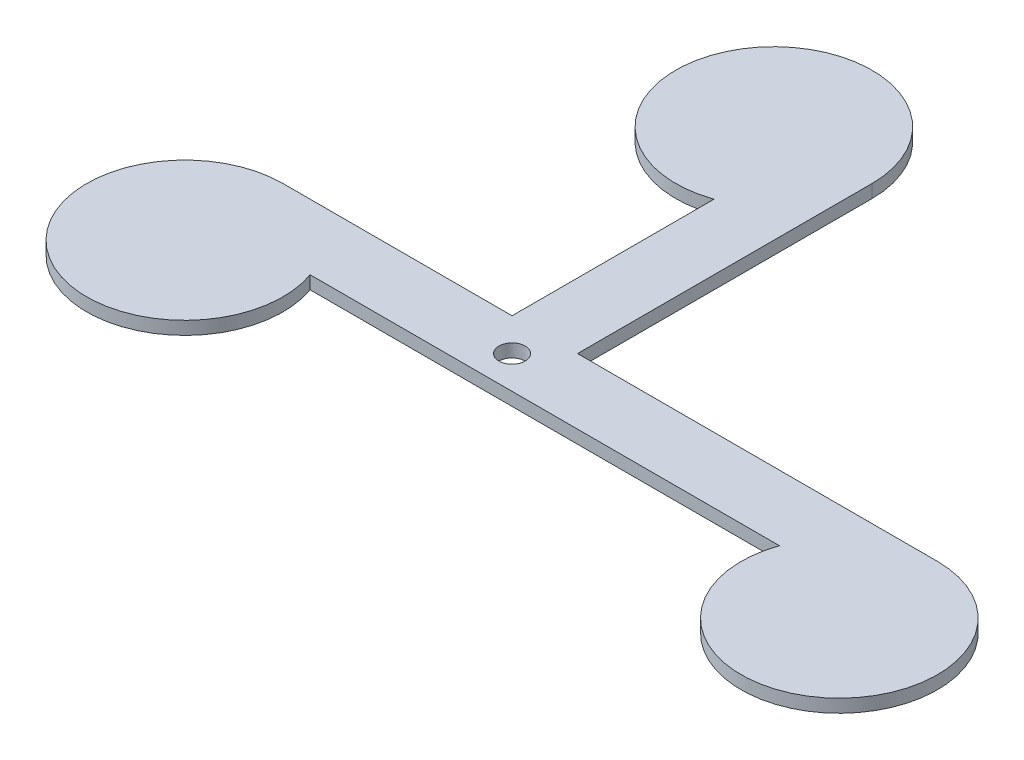
ISO-10303-21;
HEADER;
FILE_DESCRIPTION(('STEP AP214'),'2;1');
FILE_NAME('part.step','',(''),(''),'','','');
FILE_SCHEMA(('AUTOMOTIVE_DESIGN { 1 0 10303 214 1 1 1 1 }'));
ENDSEC;
DATA;
#1=APPLICATION_CONTEXT('core data for automotive mechanical design processes');
#2=APPLICATION_PROTOCOL_DEFINITION('international standard','automotive_design',2000,#1);
#3=PRODUCT_CONTEXT('',#1,'mechanical');
#4=PRODUCT('Part','Part','',(#3));
#5=PRODUCT_RELATED_PRODUCT_CATEGORY('part','',(#4));
#6=PRODUCT_DEFINITION_FORMATION('','',#4);
#7=PRODUCT_DEFINITION_CONTEXT('part definition',#1,'design');
#8=PRODUCT_DEFINITION('design','',#6,#7);
#9=PRODUCT_DEFINITION_SHAPE('','',#8);
#10=(LENGTH_UNIT() NAMED_UNIT(*) SI_UNIT(.MILLI.,.METRE.));
#11=(NAMED_UNIT(*) PLANE_ANGLE_UNIT() SI_UNIT($,.RADIAN.));
#12=(NAMED_UNIT(*) SI_UNIT($,.STERADIAN.) SOLID_ANGLE_UNIT());
#13=UNCERTAINTY_MEASURE_WITH_UNIT(LENGTH_MEASURE(1.E-05),#10,'distance_accuracy_value','');
#14=(GEOMETRIC_REPRESENTATION_CONTEXT(3) GLOBAL_UNCERTAINTY_ASSIGNED_CONTEXT((#13)) GLOBAL_UNIT_ASSIGNED_CONTEXT((#10,
#11,#12)) REPRESENTATION_CONTEXT('',''));
#15=CARTESIAN_POINT('',(0.,0.,0.));
#16=DIRECTION('',(0.,0.,1.));
#17=DIRECTION('',(1.,0.,0.));
#18=AXIS2_PLACEMENT_3D('',#15,#16,#17);
#19=CARTESIAN_POINT('',(45.,2.,-15.));
#20=DIRECTION('',(-1.,0.,0.));
#21=DIRECTION('',(0.,0.,1.));
#22=AXIS2_PLACEMENT_3D('',#19,#20,#21);
#23=PLANE('',#22);
#24=DIRECTION('',(0.,0.,-1.));
#25=VECTOR('',#24,1.);
#26=CARTESIAN_POINT('',(45.,0.,-15.));
#27=LINE('',#26,#25);
#28=CARTESIAN_POINT('',(45.,0.,-15.));
#29=VERTEX_POINT('',#28);
#30=CARTESIAN_POINT('',(45.,0.,-60.));
#31=VERTEX_POINT('',#30);
#32=EDGE_CURVE('E131',#29,#31,#27,.T.);
#33=ORIENTED_EDGE('',*,*,#32,.T.);
#34=DIRECTION('',(0.,-1.,0.));
#35=VECTOR('',#34,1.);
#36=CARTESIAN_POINT('',(45.,2.,-60.));
#37=LINE('',#36,#35);
#38=CARTESIAN_POINT('',(45.,2.,-60.));
#39=VERTEX_POINT('',#38);
#40=EDGE_CURVE('E162',#39,#31,#37,.T.);
#41=ORIENTED_EDGE('',*,*,#40,.F.);
#42=DIRECTION('',(0.,0.,-1.));
#43=VECTOR('',#42,1.);
#44=CARTESIAN_POINT('',(45.,2.,-15.));
#45=LINE('',#44,#43);
#46=CARTESIAN_POINT('',(45.,2.,-15.));
#47=VERTEX_POINT('',#46);
#48=EDGE_CURVE('E151',#47,#39,#45,.T.);
#49=ORIENTED_EDGE('',*,*,#48,.F.);
#50=DIRECTION('',(0.,-1.,0.));
#51=VECTOR('',#50,1.);
#52=CARTESIAN_POINT('',(45.,2.,-15.));
#53=LINE('',#52,#51);
#54=EDGE_CURVE('E50',#47,#29,#53,.T.);
#55=ORIENTED_EDGE('',*,*,#54,.T.);
#56=EDGE_LOOP('',(#33,#41,#49,#55));
#57=FACE_BOUND('',#56,.T.);
#58=ADVANCED_FACE('F33',(#57),#23,.F.);
#59=CARTESIAN_POINT('',(30.,2.,-60.));
#60=DIRECTION('',(0.,-1.,0.));
#61=DIRECTION('',(0.,0.,-1.));
#62=AXIS2_PLACEMENT_3D('',#59,#60,#61);
#63=CYLINDRICAL_SURFACE('',#62,15.);
#64=CARTESIAN_POINT('',(30.,0.,-60.));
#65=DIRECTION('',(0.,1.,0.));
#66=DIRECTION('',(0.,0.,1.));
#67=AXIS2_PLACEMENT_3D('',#64,#65,#66);
#68=CIRCLE('',#67,15.);
#69=CARTESIAN_POINT('',(35.,0.,-45.857864376269));
#70=VERTEX_POINT('',#69);
#71=EDGE_CURVE('E133',#31,#70,#68,.T.);
#72=ORIENTED_EDGE('',*,*,#71,.T.);
#73=DIRECTION('',(0.,-1.,0.));
#74=VECTOR('',#73,1.);
#75=CARTESIAN_POINT('',(35.,2.,-45.857864376269));
#76=LINE('',#75,#74);
#77=CARTESIAN_POINT('',(35.,2.,-45.857864376269));
#78=VERTEX_POINT('',#77);
#79=EDGE_CURVE('E160',#78,#70,#76,.T.);
#80=ORIENTED_EDGE('',*,*,#79,.F.);
#81=CARTESIAN_POINT('',(30.,2.,-60.));
#82=DIRECTION('',(0.,1.,0.));
#83=DIRECTION('',(0.,0.,1.));
#84=AXIS2_PLACEMENT_3D('',#81,#82,#83);
#85=CIRCLE('',#84,15.);
#86=EDGE_CURVE('E90',#39,#78,#85,.T.);
#87=ORIENTED_EDGE('',*,*,#86,.F.);
#88=ORIENTED_EDGE('',*,*,#40,.T.);
#89=EDGE_LOOP('',(#72,#80,#87,#88));
#90=FACE_BOUND('',#89,.T.);
#91=ADVANCED_FACE('F180',(#90),#63,.T.);
#92=CARTESIAN_POINT('',(35.,2.,-15.));
#93=DIRECTION('',(-1.,0.,0.));
#94=DIRECTION('',(0.,0.,1.));
#95=AXIS2_PLACEMENT_3D('',#92,#93,#94);
#96=PLANE('',#95);
#97=DIRECTION('',(0.,0.,-1.));
#98=VECTOR('',#97,1.);
#99=CARTESIAN_POINT('',(35.,0.,-15.));
#100=LINE('',#99,#98);
#101=CARTESIAN_POINT('',(35.,0.,-15.));
#102=VERTEX_POINT('',#101);
#103=EDGE_CURVE('E137',#102,#70,#100,.T.);
#104=ORIENTED_EDGE('',*,*,#103,.F.);
#105=DIRECTION('',(0.,-1.,0.));
#106=VECTOR('',#105,1.);
#107=CARTESIAN_POINT('',(35.,2.,-15.));
#108=LINE('',#107,#106);
#109=CARTESIAN_POINT('',(35.,2.,-15.));
#110=VERTEX_POINT('',#109);
#111=EDGE_CURVE('E158',#110,#102,#108,.T.);
#112=ORIENTED_EDGE('',*,*,#111,.F.);
#113=DIRECTION('',(0.,0.,-1.));
#114=VECTOR('',#113,1.);
#115=CARTESIAN_POINT('',(35.,2.,-15.));
#116=LINE('',#115,#114);
#117=EDGE_CURVE('E234',#110,#78,#116,.T.);
#118=ORIENTED_EDGE('',*,*,#117,.T.);
#119=ORIENTED_EDGE('',*,*,#79,.T.);
#120=EDGE_LOOP('',(#104,#112,#118,#119));
#121=FACE_BOUND('',#120,.T.);
#122=ADVANCED_FACE('F184',(#121),#96,.T.);
#123=CARTESIAN_POINT('',(35.,2.,-15.));
#124=DIRECTION('',(0.,0.,1.));
#125=DIRECTION('',(1.,0.,0.));
#126=AXIS2_PLACEMENT_3D('',#123,#124,#125);
#127=PLANE('',#126);
#128=DIRECTION('',(-1.,0.,0.));
#129=VECTOR('',#128,1.);
#130=CARTESIAN_POINT('',(35.,0.,-15.));
#131=LINE('',#130,#129);
#132=CARTESIAN_POINT('',(0.,0.,-15.));
#133=VERTEX_POINT('',#132);
#134=EDGE_CURVE('E140',#102,#133,#131,.T.);
#135=ORIENTED_EDGE('',*,*,#134,.T.);
#136=DIRECTION('',(0.,-1.,0.));
#137=VECTOR('',#136,1.);
#138=CARTESIAN_POINT('',(0.,2.,-15.));
#139=LINE('',#138,#137);
#140=CARTESIAN_POINT('',(0.,2.,-15.));
#141=VERTEX_POINT('',#140);
#142=EDGE_CURVE('E155',#141,#133,#139,.T.);
#143=ORIENTED_EDGE('',*,*,#142,.F.);
#144=DIRECTION('',(-1.,0.,0.));
#145=VECTOR('',#144,1.);
#146=CARTESIAN_POINT('',(35.,2.,-15.));
#147=LINE('',#146,#145);
#148=EDGE_CURVE('E235',#110,#141,#147,.T.);
#149=ORIENTED_EDGE('',*,*,#148,.F.);
#150=ORIENTED_EDGE('',*,*,#111,.T.);
#151=EDGE_LOOP('',(#135,#143,#149,#150));
#152=FACE_BOUND('',#151,.T.);
#153=ADVANCED_FACE('F189',(#152),#127,.F.);
#154=CARTESIAN_POINT('',(0.,2.,0.));
#155=DIRECTION('',(0.,-1.,0.));
#156=DIRECTION('',(0.,0.,-1.));
#157=AXIS2_PLACEMENT_3D('',#154,#155,#156);
#158=CYLINDRICAL_SURFACE('',#157,15.);
#159=CARTESIAN_POINT('',(0.,0.,0.));
#160=DIRECTION('',(0.,1.,0.));
#161=DIRECTION('',(0.,0.,1.));
#162=AXIS2_PLACEMENT_3D('',#159,#160,#161);
#163=CIRCLE('',#162,15.);
#164=CARTESIAN_POINT('',(14.1421356237309,0.,-5.00000000000001));
#165=VERTEX_POINT('',#164);
#166=EDGE_CURVE('E142',#133,#165,#163,.T.);
#167=ORIENTED_EDGE('',*,*,#166,.T.);
#168=DIRECTION('',(0.,-1.,0.));
#169=VECTOR('',#168,1.);
#170=CARTESIAN_POINT('',(14.1421356237309,2.,-5.00000000000001));
#171=LINE('',#170,#169);
#172=CARTESIAN_POINT('',(14.1421356237309,2.,-5.00000000000001));
#173=VERTEX_POINT('',#172);
#174=EDGE_CURVE('E123',#173,#165,#171,.T.);
#175=ORIENTED_EDGE('',*,*,#174,.F.);
#176=CARTESIAN_POINT('',(0.,2.,0.));
#177=DIRECTION('',(0.,1.,0.));
#178=DIRECTION('',(0.,0.,1.));
#179=AXIS2_PLACEMENT_3D('',#176,#177,#178);
#180=CIRCLE('',#179,15.);
#181=EDGE_CURVE('E112',#141,#173,#180,.T.);
#182=ORIENTED_EDGE('',*,*,#181,.F.);
#183=ORIENTED_EDGE('',*,*,#142,.T.);
#184=EDGE_LOOP('',(#167,#175,#182,#183));
#185=FACE_BOUND('',#184,.T.);
#186=ADVANCED_FACE('F193',(#185),#158,.T.);
#187=CARTESIAN_POINT('',(45.,2.,-5.));
#188=DIRECTION('',(0.,0.,-1.));
#189=DIRECTION('',(-1.,0.,0.));
#190=AXIS2_PLACEMENT_3D('',#187,#188,#189);
#191=PLANE('',#190);
#192=DIRECTION('',(1.,0.,0.));
#193=VECTOR('',#192,1.);
#194=CARTESIAN_POINT('',(45.,0.,-5.));
#195=LINE('',#194,#193);
#196=CARTESIAN_POINT('',(85.857864376269,0.,-5.));
#197=VERTEX_POINT('',#196);
#198=EDGE_CURVE('E120',#165,#197,#195,.T.);
#199=ORIENTED_EDGE('',*,*,#198,.T.);
#200=DIRECTION('',(0.,-1.,0.));
#201=VECTOR('',#200,1.);
#202=CARTESIAN_POINT('',(85.857864376269,2.,-5.));
#203=LINE('',#202,#201);
#204=CARTESIAN_POINT('',(85.857864376269,2.,-5.));
#205=VERTEX_POINT('',#204);
#206=EDGE_CURVE('E118',#205,#197,#203,.T.);
#207=ORIENTED_EDGE('',*,*,#206,.F.);
#208=DIRECTION('',(-1.,0.,0.));
#209=VECTOR('',#208,1.);
#210=CARTESIAN_POINT('',(45.,2.,-5.));
#211=LINE('',#210,#209);
#212=EDGE_CURVE('E105',#205,#173,#211,.T.);
#213=ORIENTED_EDGE('',*,*,#212,.T.);
#214=ORIENTED_EDGE('',*,*,#174,.T.);
#215=EDGE_LOOP('',(#199,#207,#213,#214));
#216=FACE_BOUND('',#215,.T.);
#217=ADVANCED_FACE('F119',(#216),#191,.F.);
#218=CARTESIAN_POINT('',(100.,2.,0.));
#219=DIRECTION('',(0.,-1.,0.));
#220=DIRECTION('',(0.,0.,-1.));
#221=AXIS2_PLACEMENT_3D('',#218,#219,#220);
#222=CYLINDRICAL_SURFACE('',#221,15.);
#223=CARTESIAN_POINT('',(100.,0.,0.));
#224=DIRECTION('',(0.,1.,0.));
#225=DIRECTION('',(0.,0.,1.));
#226=AXIS2_PLACEMENT_3D('',#223,#224,#225);
#227=CIRCLE('',#226,15.);
#228=CARTESIAN_POINT('',(100.,0.,-15.));
#229=VERTEX_POINT('',#228);
#230=EDGE_CURVE('E146',#197,#229,#227,.T.);
#231=ORIENTED_EDGE('',*,*,#230,.T.);
#232=DIRECTION('',(0.,-1.,0.));
#233=VECTOR('',#232,1.);
#234=CARTESIAN_POINT('',(100.,2.,-15.));
#235=LINE('',#234,#233);
#236=CARTESIAN_POINT('',(100.,2.,-15.));
#237=VERTEX_POINT('',#236);
#238=EDGE_CURVE('E77',#237,#229,#235,.T.);
#239=ORIENTED_EDGE('',*,*,#238,.F.);
#240=CARTESIAN_POINT('',(100.,2.,0.));
#241=DIRECTION('',(0.,1.,0.));
#242=DIRECTION('',(0.,0.,1.));
#243=AXIS2_PLACEMENT_3D('',#240,#241,#242);
#244=CIRCLE('',#243,15.);
#245=EDGE_CURVE('E110',#205,#237,#244,.T.);
#246=ORIENTED_EDGE('',*,*,#245,.F.);
#247=ORIENTED_EDGE('',*,*,#206,.T.);
#248=EDGE_LOOP('',(#231,#239,#246,#247));
#249=FACE_BOUND('',#248,.T.);
#250=ADVANCED_FACE('F125',(#249),#222,.T.);
#251=CARTESIAN_POINT('',(45.,2.,-15.));
#252=DIRECTION('',(0.,0.,-1.));
#253=DIRECTION('',(-1.,0.,0.));
#254=AXIS2_PLACEMENT_3D('',#251,#252,#253);
#255=PLANE('',#254);
#256=DIRECTION('',(1.,0.,0.));
#257=VECTOR('',#256,1.);
#258=CARTESIAN_POINT('',(45.,0.,-15.));
#259=LINE('',#258,#257);
#260=EDGE_CURVE('E148',#29,#229,#259,.T.);
#261=ORIENTED_EDGE('',*,*,#260,.F.);
#262=ORIENTED_EDGE('',*,*,#54,.F.);
#263=DIRECTION('',(1.,0.,0.));
#264=VECTOR('',#263,1.);
#265=CARTESIAN_POINT('',(45.,2.,-15.));
#266=LINE('',#265,#264);
#267=EDGE_CURVE('E126',#47,#237,#266,.T.);
#268=ORIENTED_EDGE('',*,*,#267,.T.);
#269=ORIENTED_EDGE('',*,*,#238,.T.);
#270=EDGE_LOOP('',(#261,#262,#268,#269));
#271=FACE_BOUND('',#270,.T.);
#272=ADVANCED_FACE('F202',(#271),#255,.T.);
#273=CARTESIAN_POINT('',(30.,2.,-60.));
#274=DIRECTION('',(0.,1.,0.));
#275=DIRECTION('',(0.,0.,1.));
#276=AXIS2_PLACEMENT_3D('',#273,#274,#275);
#277=PLANE('',#276);
#278=CARTESIAN_POINT('',(40.,2.,-10.));
#279=DIRECTION('',(0.,-1.,0.));
#280=DIRECTION('',(0.,0.,-1.));
#281=AXIS2_PLACEMENT_3D('',#278,#279,#280);
#282=CIRCLE('',#281,2.);
#283=CARTESIAN_POINT('',(40.,2.,-12.));
#284=VERTEX_POINT('',#283);
#285=EDGE_CURVE('E134',#284,#284,#282,.T.);
#286=ORIENTED_EDGE('',*,*,#285,.T.);
#287=EDGE_LOOP('',(#286));
#288=FACE_BOUND('',#287,.T.);
#289=ORIENTED_EDGE('',*,*,#48,.T.);
#290=ORIENTED_EDGE('',*,*,#86,.T.);
#291=ORIENTED_EDGE('',*,*,#117,.F.);
#292=ORIENTED_EDGE('',*,*,#148,.T.);
#293=ORIENTED_EDGE('',*,*,#181,.T.);
#294=ORIENTED_EDGE('',*,*,#212,.F.);
#295=ORIENTED_EDGE('',*,*,#245,.T.);
#296=ORIENTED_EDGE('',*,*,#267,.F.);
#297=EDGE_LOOP('',(#289,#290,#291,#292,#293,#294,#295,#296));
#298=FACE_BOUND('',#297,.T.);
#299=ADVANCED_FACE('F107',(#288,#298),#277,.T.);
#300=CARTESIAN_POINT('',(30.,0.,-60.));
#301=DIRECTION('',(0.,1.,0.));
#302=DIRECTION('',(0.,0.,1.));
#303=AXIS2_PLACEMENT_3D('',#300,#301,#302);
#304=PLANE('',#303);
#305=CARTESIAN_POINT('',(40.,0.,-16.5));
#306=DIRECTION('',(0.,1.,0.));
#307=DIRECTION('',(0.,0.,1.));
#308=AXIS2_PLACEMENT_3D('',#305,#306,#307);
#309=CIRCLE('',#308,2.45);
#310=CARTESIAN_POINT('',(40.,0.,-14.05));
#311=VERTEX_POINT('',#310);
#312=EDGE_CURVE('E164',#311,#311,#309,.F.);
#313=ORIENTED_EDGE('',*,*,#312,.F.);
#314=EDGE_LOOP('',(#313));
#315=FACE_BOUND('',#314,.T.);
#316=CARTESIAN_POINT('',(40.,0.,-10.));
#317=DIRECTION('',(0.,-1.,0.));
#318=DIRECTION('',(0.,0.,-1.));
#319=AXIS2_PLACEMENT_3D('',#316,#317,#318);
#320=CIRCLE('',#319,2.);
#321=CARTESIAN_POINT('',(40.,0.,-12.));
#322=VERTEX_POINT('',#321);
#323=EDGE_CURVE('E226',#322,#322,#320,.T.);
#324=ORIENTED_EDGE('',*,*,#323,.F.);
#325=EDGE_LOOP('',(#324));
#326=FACE_BOUND('',#325,.T.);
#327=ORIENTED_EDGE('',*,*,#32,.F.);
#328=ORIENTED_EDGE('',*,*,#260,.T.);
#329=ORIENTED_EDGE('',*,*,#230,.F.);
#330=ORIENTED_EDGE('',*,*,#198,.F.);
#331=ORIENTED_EDGE('',*,*,#166,.F.);
#332=ORIENTED_EDGE('',*,*,#134,.F.);
#333=ORIENTED_EDGE('',*,*,#103,.T.);
#334=ORIENTED_EDGE('',*,*,#71,.F.);
#335=EDGE_LOOP('',(#327,#328,#329,#330,#331,#332,#333,#334));
#336=FACE_BOUND('',#335,.T.);
#337=ADVANCED_FACE('F205',(#315,#326,#336),#304,.F.);
#338=CARTESIAN_POINT('',(40.,2.,-10.));
#339=DIRECTION('',(0.,-1.,0.));
#340=DIRECTION('',(0.,0.,-1.));
#341=AXIS2_PLACEMENT_3D('',#338,#339,#340);
#342=CYLINDRICAL_SURFACE('',#341,2.);
#343=ORIENTED_EDGE('',*,*,#285,.F.);
#344=EDGE_LOOP('',(#343));
#345=FACE_BOUND('',#344,.T.);
#346=ORIENTED_EDGE('',*,*,#323,.T.);
#347=EDGE_LOOP('',(#346));
#348=FACE_BOUND('',#347,.T.);
#349=ADVANCED_FACE('F208',(#345,#348),#342,.F.);
#350=CARTESIAN_POINT('',(40.,-2.,-16.5));
#351=DIRECTION('',(0.,1.,0.));
#352=DIRECTION('',(0.,0.,1.));
#353=AXIS2_PLACEMENT_3D('',#350,#351,#352);
#354=CYLINDRICAL_SURFACE('',#353,2.45);
#355=CARTESIAN_POINT('',(40.,-1.,-16.5));
#356=DIRECTION('',(0.,-1.,0.));
#357=DIRECTION('',(0.,0.,-1.));
#358=AXIS2_PLACEMENT_3D('',#355,#356,#357);
#359=CIRCLE('',#358,2.45);
#360=CARTESIAN_POINT('',(40.,-1.,-18.95));
#361=VERTEX_POINT('',#360);
#362=EDGE_CURVE('E11',#361,#361,#359,.F.);
#363=ORIENTED_EDGE('',*,*,#362,.T.);
#364=EDGE_LOOP('',(#363));
#365=FACE_BOUND('',#364,.T.);
#366=ORIENTED_EDGE('',*,*,#312,.T.);
#367=EDGE_LOOP('',(#366));
#368=FACE_BOUND('',#367,.T.);
#369=ADVANCED_FACE('F176',(#365,#368),#354,.T.);
#370=CARTESIAN_POINT('',(40.,-2.,-16.5));
#371=DIRECTION('',(0.,-1.,0.));
#372=DIRECTION('',(0.,0.,-1.));
#373=AXIS2_PLACEMENT_3D('',#370,#371,#372);
#374=PLANE('',#373);
#375=CARTESIAN_POINT('',(40.,-2.,-16.5));
#376=DIRECTION('',(0.,-1.,0.));
#377=DIRECTION('',(0.,0.,-1.));
#378=AXIS2_PLACEMENT_3D('',#375,#376,#377);
#379=CIRCLE('',#378,1.45);
#380=CARTESIAN_POINT('',(40.,-2.,-17.95));
#381=VERTEX_POINT('',#380);
#382=EDGE_CURVE('E42',#381,#381,#379,.T.);
#383=ORIENTED_EDGE('',*,*,#382,.T.);
#384=EDGE_LOOP('',(#383));
#385=FACE_BOUND('',#384,.T.);
#386=ADVANCED_FACE('F169',(#385),#374,.T.);
#387=CARTESIAN_POINT('',(40.,-1.,-16.5));
#388=DIRECTION('',(0.,-1.,0.));
#389=DIRECTION('',(0.,0.,-1.));
#390=AXIS2_PLACEMENT_3D('',#387,#388,#389);
#391=TOROIDAL_SURFACE('',#390,1.45,1.);
#392=ORIENTED_EDGE('',*,*,#362,.F.);
#393=EDGE_LOOP('',(#392));
#394=FACE_BOUND('',#393,.T.);
#395=ORIENTED_EDGE('',*,*,#382,.F.);
#396=EDGE_LOOP('',(#395));
#397=FACE_BOUND('',#396,.T.);
#398=ADVANCED_FACE('F35',(#394,#397),#391,.T.);
#399=CLOSED_SHELL('',(#58,#91,#122,#153,#186,#217,#250,#272,#299,#337,#349,#369,#386,#398));
#400=MANIFOLD_SOLID_BREP('B2',#399);
#401=ADVANCED_BREP_SHAPE_REPRESENTATION('',(#18,#400),#14);
#402=SHAPE_DEFINITION_REPRESENTATION(#9,#401);
ENDSEC;
END-ISO-10303-21;
